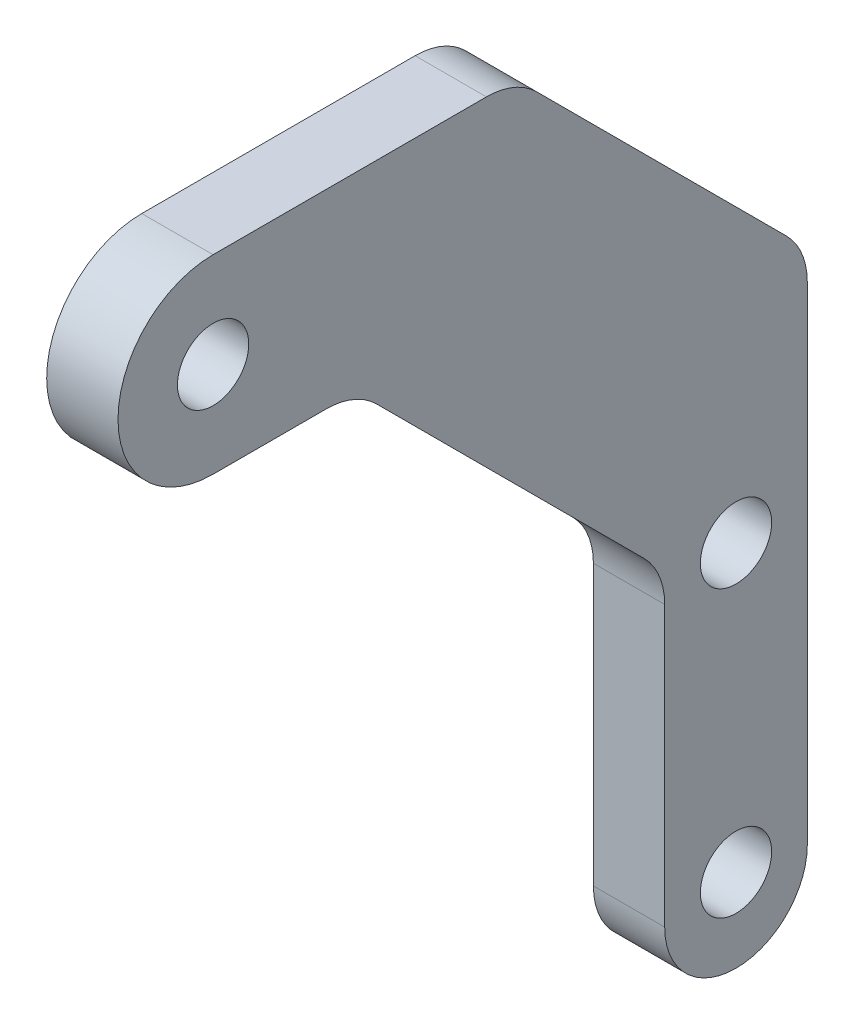
ISO-10303-21;
HEADER;
FILE_DESCRIPTION(('STEP AP214'),'2;1');
FILE_NAME('part.step','',(''),(''),'','','');
FILE_SCHEMA(('AUTOMOTIVE_DESIGN { 1 0 10303 214 1 1 1 1 }'));
ENDSEC;
DATA;
#1=APPLICATION_CONTEXT('core data for automotive mechanical design processes');
#2=APPLICATION_PROTOCOL_DEFINITION('international standard','automotive_design',2000,#1);
#3=PRODUCT_CONTEXT('',#1,'mechanical');
#4=PRODUCT('Part','Part','',(#3));
#5=PRODUCT_RELATED_PRODUCT_CATEGORY('part','',(#4));
#6=PRODUCT_DEFINITION_FORMATION('','',#4);
#7=PRODUCT_DEFINITION_CONTEXT('part definition',#1,'design');
#8=PRODUCT_DEFINITION('design','',#6,#7);
#9=PRODUCT_DEFINITION_SHAPE('','',#8);
#10=(LENGTH_UNIT() NAMED_UNIT(*) SI_UNIT(.MILLI.,.METRE.));
#11=(NAMED_UNIT(*) PLANE_ANGLE_UNIT() SI_UNIT($,.RADIAN.));
#12=(NAMED_UNIT(*) SI_UNIT($,.STERADIAN.) SOLID_ANGLE_UNIT());
#13=UNCERTAINTY_MEASURE_WITH_UNIT(LENGTH_MEASURE(1.E-05),#10,'distance_accuracy_value','');
#14=(GEOMETRIC_REPRESENTATION_CONTEXT(3) GLOBAL_UNCERTAINTY_ASSIGNED_CONTEXT((#13)) GLOBAL_UNIT_ASSIGNED_CONTEXT((#10,
#11,#12)) REPRESENTATION_CONTEXT('',''));
#15=CARTESIAN_POINT('',(0.,0.,0.));
#16=DIRECTION('',(0.,0.,1.));
#17=DIRECTION('',(1.,0.,0.));
#18=AXIS2_PLACEMENT_3D('',#15,#16,#17);
#19=CARTESIAN_POINT('',(1.5,33.,91.));
#20=DIRECTION('',(1.,0.,0.));
#21=DIRECTION('',(0.,0.,-1.));
#22=AXIS2_PLACEMENT_3D('',#19,#20,#21);
#23=PLANE('',#22);
#24=CARTESIAN_POINT('',(1.5,33.,91.));
#25=DIRECTION('',(1.,0.,0.));
#26=DIRECTION('',(0.,0.,-1.));
#27=AXIS2_PLACEMENT_3D('',#24,#25,#26);
#28=CIRCLE('',#27,1.5);
#29=CARTESIAN_POINT('',(1.5,33.,89.5));
#30=VERTEX_POINT('',#29);
#31=EDGE_CURVE('E413',#30,#30,#28,.T.);
#32=ORIENTED_EDGE('',*,*,#31,.F.);
#33=EDGE_LOOP('',(#32));
#34=FACE_BOUND('',#33,.T.);
#35=DIRECTION('',(0.,1.,0.));
#36=VECTOR('',#35,1.);
#37=CARTESIAN_POINT('',(1.5,0.,66.));
#38=LINE('',#37,#36);
#39=CARTESIAN_POINT('',(1.5,3.,66.));
#40=VERTEX_POINT('',#39);
#41=CARTESIAN_POINT('',(1.5,23.5,66.));
#42=VERTEX_POINT('',#41);
#43=EDGE_CURVE('E219',#40,#42,#38,.T.);
#44=ORIENTED_EDGE('',*,*,#43,.T.);
#45=CARTESIAN_POINT('',(1.5,23.5,69.));
#46=DIRECTION('',(1.,0.,0.));
#47=DIRECTION('',(0.,0.,-1.));
#48=AXIS2_PLACEMENT_3D('',#45,#46,#47);
#49=CIRCLE('',#48,3.);
#50=CARTESIAN_POINT('',(1.5,25.6213203435596,66.8786796564403));
#51=VERTEX_POINT('',#50);
#52=EDGE_CURVE('E178',#42,#51,#49,.T.);
#53=ORIENTED_EDGE('',*,*,#52,.T.);
#54=DIRECTION('',(0.,0.707106781186549,0.707106781186546));
#55=VECTOR('',#54,1.);
#56=CARTESIAN_POINT('',(1.5,37.,78.2573593128807));
#57=LINE('',#56,#55);
#58=CARTESIAN_POINT('',(1.5,36.1213203435596,77.3786796564403));
#59=VERTEX_POINT('',#58);
#60=EDGE_CURVE('E223',#51,#59,#57,.T.);
#61=ORIENTED_EDGE('',*,*,#60,.T.);
#62=CARTESIAN_POINT('',(1.5,34.,79.5));
#63=DIRECTION('',(1.,0.,0.));
#64=DIRECTION('',(0.,0.,-1.));
#65=AXIS2_PLACEMENT_3D('',#62,#63,#64);
#66=CIRCLE('',#65,3.);
#67=CARTESIAN_POINT('',(1.5,37.,79.5));
#68=VERTEX_POINT('',#67);
#69=EDGE_CURVE('E48',#59,#68,#66,.T.);
#70=ORIENTED_EDGE('',*,*,#69,.T.);
#71=DIRECTION('',(0.,0.,1.));
#72=VECTOR('',#71,1.);
#73=CARTESIAN_POINT('',(1.5,37.,78.2573593128807));
#74=LINE('',#73,#72);
#75=CARTESIAN_POINT('',(1.5,37.,91.));
#76=VERTEX_POINT('',#75);
#77=EDGE_CURVE('E143',#68,#76,#74,.T.);
#78=ORIENTED_EDGE('',*,*,#77,.T.);
#79=CARTESIAN_POINT('',(1.5,33.,91.));
#80=DIRECTION('',(1.,0.,0.));
#81=DIRECTION('',(0.,0.,-1.));
#82=AXIS2_PLACEMENT_3D('',#79,#80,#81);
#83=CIRCLE('',#82,4.);
#84=CARTESIAN_POINT('',(1.5,29.,91.));
#85=VERTEX_POINT('',#84);
#86=EDGE_CURVE('E138',#76,#85,#83,.T.);
#87=ORIENTED_EDGE('',*,*,#86,.T.);
#88=DIRECTION('',(0.,0.,-1.));
#89=VECTOR('',#88,1.);
#90=CARTESIAN_POINT('',(1.5,29.,91.));
#91=LINE('',#90,#89);
#92=CARTESIAN_POINT('',(1.5,29.,86.2426406871192));
#93=VERTEX_POINT('',#92);
#94=EDGE_CURVE('E127',#85,#93,#91,.T.);
#95=ORIENTED_EDGE('',*,*,#94,.T.);
#96=CARTESIAN_POINT('',(1.5,26.,86.2426406871192));
#97=DIRECTION('',(1.,0.,0.));
#98=DIRECTION('',(0.,0.,-1.));
#99=AXIS2_PLACEMENT_3D('',#96,#97,#98);
#100=CIRCLE('',#99,3.);
#101=CARTESIAN_POINT('',(1.5,28.1213203435596,84.1213203435596));
#102=VERTEX_POINT('',#101);
#103=EDGE_CURVE('E11',#93,#102,#100,.F.);
#104=ORIENTED_EDGE('',*,*,#103,.T.);
#105=DIRECTION('',(0.,-0.707106781186549,-0.707106781186546));
#106=VECTOR('',#105,1.);
#107=CARTESIAN_POINT('',(1.5,29.,85.));
#108=LINE('',#107,#106);
#109=CARTESIAN_POINT('',(1.5,16.8786796564403,72.8786796564404));
#110=VERTEX_POINT('',#109);
#111=EDGE_CURVE('E137',#102,#110,#108,.T.);
#112=ORIENTED_EDGE('',*,*,#111,.T.);
#113=CARTESIAN_POINT('',(1.5,14.7573593128807,75.));
#114=DIRECTION('',(1.,0.,0.));
#115=DIRECTION('',(0.,0.,-1.));
#116=AXIS2_PLACEMENT_3D('',#113,#114,#115);
#117=CIRCLE('',#116,3.);
#118=CARTESIAN_POINT('',(1.5,14.7573593128807,72.));
#119=VERTEX_POINT('',#118);
#120=EDGE_CURVE('E197',#110,#119,#117,.F.);
#121=ORIENTED_EDGE('',*,*,#120,.T.);
#122=DIRECTION('',(0.,-1.,0.));
#123=VECTOR('',#122,1.);
#124=CARTESIAN_POINT('',(1.5,16.,72.));
#125=LINE('',#124,#123);
#126=CARTESIAN_POINT('',(1.5,3.,72.));
#127=VERTEX_POINT('',#126);
#128=EDGE_CURVE('E217',#119,#127,#125,.T.);
#129=ORIENTED_EDGE('',*,*,#128,.T.);
#130=CARTESIAN_POINT('',(1.5,3.,69.));
#131=DIRECTION('',(1.,0.,0.));
#132=DIRECTION('',(0.,0.,-1.));
#133=AXIS2_PLACEMENT_3D('',#130,#131,#132);
#134=CIRCLE('',#133,3.);
#135=CARTESIAN_POINT('',(1.5,0.,69.));
#136=VERTEX_POINT('',#135);
#137=EDGE_CURVE('E55',#127,#136,#134,.T.);
#138=ORIENTED_EDGE('',*,*,#137,.T.);
#139=CARTESIAN_POINT('',(1.5,3.,69.));
#140=DIRECTION('',(1.,0.,0.));
#141=DIRECTION('',(0.,0.,-1.));
#142=AXIS2_PLACEMENT_3D('',#139,#140,#141);
#143=CIRCLE('',#142,3.);
#144=EDGE_CURVE('E174',#136,#40,#143,.T.);
#145=ORIENTED_EDGE('',*,*,#144,.T.);
#146=EDGE_LOOP('',(#44,#53,#61,#70,#78,#87,#95,#104,#112,#121,#129,#138,#145));
#147=FACE_BOUND('',#146,.T.);
#148=CARTESIAN_POINT('',(1.5,3.49999999999999,69.));
#149=DIRECTION('',(1.,0.,0.));
#150=DIRECTION('',(0.,0.,-1.));
#151=AXIS2_PLACEMENT_3D('',#148,#149,#150);
#152=CIRCLE('',#151,1.5);
#153=CARTESIAN_POINT('',(1.5,3.49999999999999,67.5));
#154=VERTEX_POINT('',#153);
#155=EDGE_CURVE('E226',#154,#154,#152,.T.);
#156=ORIENTED_EDGE('',*,*,#155,.F.);
#157=EDGE_LOOP('',(#156));
#158=FACE_BOUND('',#157,.T.);
#159=CARTESIAN_POINT('',(1.5,15.5,69.));
#160=DIRECTION('',(1.,0.,0.));
#161=DIRECTION('',(0.,0.,-1.));
#162=AXIS2_PLACEMENT_3D('',#159,#160,#161);
#163=CIRCLE('',#162,1.5);
#164=CARTESIAN_POINT('',(1.5,15.5,67.5));
#165=VERTEX_POINT('',#164);
#166=EDGE_CURVE('E405',#165,#165,#163,.T.);
#167=ORIENTED_EDGE('',*,*,#166,.F.);
#168=EDGE_LOOP('',(#167));
#169=FACE_BOUND('',#168,.T.);
#170=ADVANCED_FACE('F32',(#34,#147,#158,#169),#23,.T.);
#171=CARTESIAN_POINT('',(-1.5,33.,91.));
#172=DIRECTION('',(1.,0.,0.));
#173=DIRECTION('',(0.,0.,-1.));
#174=AXIS2_PLACEMENT_3D('',#171,#172,#173);
#175=PLANE('',#174);
#176=CARTESIAN_POINT('',(-1.5,33.,91.));
#177=DIRECTION('',(1.,0.,0.));
#178=DIRECTION('',(0.,0.,-1.));
#179=AXIS2_PLACEMENT_3D('',#176,#177,#178);
#180=CIRCLE('',#179,1.5);
#181=CARTESIAN_POINT('',(-1.5,33.,89.5));
#182=VERTEX_POINT('',#181);
#183=EDGE_CURVE('E410',#182,#182,#180,.T.);
#184=ORIENTED_EDGE('',*,*,#183,.T.);
#185=EDGE_LOOP('',(#184));
#186=FACE_BOUND('',#185,.T.);
#187=DIRECTION('',(0.,0.707106781186549,0.707106781186546));
#188=VECTOR('',#187,1.);
#189=CARTESIAN_POINT('',(-1.5,37.,78.2573593128807));
#190=LINE('',#189,#188);
#191=CARTESIAN_POINT('',(-1.5,25.6213203435596,66.8786796564403));
#192=VERTEX_POINT('',#191);
#193=CARTESIAN_POINT('',(-1.5,36.1213203435596,77.3786796564403));
#194=VERTEX_POINT('',#193);
#195=EDGE_CURVE('E235',#192,#194,#190,.T.);
#196=ORIENTED_EDGE('',*,*,#195,.F.);
#197=CARTESIAN_POINT('',(-1.5,23.5,69.));
#198=DIRECTION('',(1.,0.,0.));
#199=DIRECTION('',(0.,0.,-1.));
#200=AXIS2_PLACEMENT_3D('',#197,#198,#199);
#201=CIRCLE('',#200,3.);
#202=CARTESIAN_POINT('',(-1.5,23.5,66.));
#203=VERTEX_POINT('',#202);
#204=EDGE_CURVE('E168',#192,#203,#201,.F.);
#205=ORIENTED_EDGE('',*,*,#204,.T.);
#206=DIRECTION('',(0.,1.,0.));
#207=VECTOR('',#206,1.);
#208=CARTESIAN_POINT('',(-1.5,0.,66.));
#209=LINE('',#208,#207);
#210=CARTESIAN_POINT('',(-1.5,3.,66.));
#211=VERTEX_POINT('',#210);
#212=EDGE_CURVE('E232',#211,#203,#209,.T.);
#213=ORIENTED_EDGE('',*,*,#212,.F.);
#214=CARTESIAN_POINT('',(-1.5,3.,69.));
#215=DIRECTION('',(1.,0.,0.));
#216=DIRECTION('',(0.,0.,-1.));
#217=AXIS2_PLACEMENT_3D('',#214,#215,#216);
#218=CIRCLE('',#217,3.);
#219=CARTESIAN_POINT('',(-1.5,0.,69.));
#220=VERTEX_POINT('',#219);
#221=EDGE_CURVE('E162',#211,#220,#218,.F.);
#222=ORIENTED_EDGE('',*,*,#221,.T.);
#223=CARTESIAN_POINT('',(-1.5,3.,69.));
#224=DIRECTION('',(1.,0.,0.));
#225=DIRECTION('',(0.,0.,-1.));
#226=AXIS2_PLACEMENT_3D('',#223,#224,#225);
#227=CIRCLE('',#226,3.);
#228=CARTESIAN_POINT('',(-1.5,3.,72.));
#229=VERTEX_POINT('',#228);
#230=EDGE_CURVE('E164',#220,#229,#227,.F.);
#231=ORIENTED_EDGE('',*,*,#230,.T.);
#232=DIRECTION('',(0.,-1.,0.));
#233=VECTOR('',#232,1.);
#234=CARTESIAN_POINT('',(-1.5,16.,72.));
#235=LINE('',#234,#233);
#236=CARTESIAN_POINT('',(-1.5,14.7573593128807,72.));
#237=VERTEX_POINT('',#236);
#238=EDGE_CURVE('E229',#237,#229,#235,.T.);
#239=ORIENTED_EDGE('',*,*,#238,.F.);
#240=CARTESIAN_POINT('',(-1.5,14.7573593128807,75.));
#241=DIRECTION('',(1.,0.,0.));
#242=DIRECTION('',(0.,0.,-1.));
#243=AXIS2_PLACEMENT_3D('',#240,#241,#242);
#244=CIRCLE('',#243,3.);
#245=CARTESIAN_POINT('',(-1.5,16.8786796564403,72.8786796564404));
#246=VERTEX_POINT('',#245);
#247=EDGE_CURVE('E195',#237,#246,#244,.T.);
#248=ORIENTED_EDGE('',*,*,#247,.T.);
#249=DIRECTION('',(0.,-0.707106781186549,-0.707106781186546));
#250=VECTOR('',#249,1.);
#251=CARTESIAN_POINT('',(-1.5,29.,85.));
#252=LINE('',#251,#250);
#253=CARTESIAN_POINT('',(-1.5,28.1213203435596,84.1213203435596));
#254=VERTEX_POINT('',#253);
#255=EDGE_CURVE('E206',#254,#246,#252,.T.);
#256=ORIENTED_EDGE('',*,*,#255,.F.);
#257=CARTESIAN_POINT('',(-1.5,26.,86.2426406871192));
#258=DIRECTION('',(1.,0.,0.));
#259=DIRECTION('',(0.,0.,-1.));
#260=AXIS2_PLACEMENT_3D('',#257,#258,#259);
#261=CIRCLE('',#260,3.);
#262=CARTESIAN_POINT('',(-1.5,29.,86.2426406871192));
#263=VERTEX_POINT('',#262);
#264=EDGE_CURVE('E41',#254,#263,#261,.T.);
#265=ORIENTED_EDGE('',*,*,#264,.T.);
#266=DIRECTION('',(0.,0.,-1.));
#267=VECTOR('',#266,1.);
#268=CARTESIAN_POINT('',(-1.5,29.,91.));
#269=LINE('',#268,#267);
#270=CARTESIAN_POINT('',(-1.5,29.,91.));
#271=VERTEX_POINT('',#270);
#272=EDGE_CURVE('E204',#271,#263,#269,.T.);
#273=ORIENTED_EDGE('',*,*,#272,.F.);
#274=CARTESIAN_POINT('',(-1.5,33.,91.));
#275=DIRECTION('',(1.,0.,0.));
#276=DIRECTION('',(0.,0.,-1.));
#277=AXIS2_PLACEMENT_3D('',#274,#275,#276);
#278=CIRCLE('',#277,4.);
#279=CARTESIAN_POINT('',(-1.5,37.,91.));
#280=VERTEX_POINT('',#279);
#281=EDGE_CURVE('E151',#280,#271,#278,.T.);
#282=ORIENTED_EDGE('',*,*,#281,.F.);
#283=DIRECTION('',(0.,0.,1.));
#284=VECTOR('',#283,1.);
#285=CARTESIAN_POINT('',(-1.5,37.,78.2573593128807));
#286=LINE('',#285,#284);
#287=CARTESIAN_POINT('',(-1.5,37.,79.5));
#288=VERTEX_POINT('',#287);
#289=EDGE_CURVE('E147',#288,#280,#286,.T.);
#290=ORIENTED_EDGE('',*,*,#289,.F.);
#291=CARTESIAN_POINT('',(-1.5,34.,79.5));
#292=DIRECTION('',(1.,0.,0.));
#293=DIRECTION('',(0.,0.,-1.));
#294=AXIS2_PLACEMENT_3D('',#291,#292,#293);
#295=CIRCLE('',#294,3.);
#296=EDGE_CURVE('E166',#288,#194,#295,.F.);
#297=ORIENTED_EDGE('',*,*,#296,.T.);
#298=EDGE_LOOP('',(#196,#205,#213,#222,#231,#239,#248,#256,#265,#273,#282,#290,#297));
#299=FACE_BOUND('',#298,.T.);
#300=CARTESIAN_POINT('',(-1.5,3.49999999999999,69.));
#301=DIRECTION('',(1.,0.,0.));
#302=DIRECTION('',(0.,0.,-1.));
#303=AXIS2_PLACEMENT_3D('',#300,#301,#302);
#304=CIRCLE('',#303,1.5);
#305=CARTESIAN_POINT('',(-1.5,3.49999999999999,67.5));
#306=VERTEX_POINT('',#305);
#307=EDGE_CURVE('E416',#306,#306,#304,.T.);
#308=ORIENTED_EDGE('',*,*,#307,.T.);
#309=EDGE_LOOP('',(#308));
#310=FACE_BOUND('',#309,.T.);
#311=CARTESIAN_POINT('',(-1.5,15.5,69.));
#312=DIRECTION('',(1.,0.,0.));
#313=DIRECTION('',(0.,0.,-1.));
#314=AXIS2_PLACEMENT_3D('',#311,#312,#313);
#315=CIRCLE('',#314,1.5);
#316=CARTESIAN_POINT('',(-1.5,15.5,67.5));
#317=VERTEX_POINT('',#316);
#318=EDGE_CURVE('E403',#317,#317,#315,.T.);
#319=ORIENTED_EDGE('',*,*,#318,.T.);
#320=EDGE_LOOP('',(#319));
#321=FACE_BOUND('',#320,.T.);
#322=ADVANCED_FACE('F202',(#186,#299,#310,#321),#175,.F.);
#323=CARTESIAN_POINT('',(1.5,33.,91.));
#324=DIRECTION('',(-1.,0.,0.));
#325=DIRECTION('',(0.,0.,1.));
#326=AXIS2_PLACEMENT_3D('',#323,#324,#325);
#327=CYLINDRICAL_SURFACE('',#326,4.);
#328=ORIENTED_EDGE('',*,*,#281,.T.);
#329=DIRECTION('',(-1.,0.,0.));
#330=VECTOR('',#329,1.);
#331=CARTESIAN_POINT('',(1.5,29.,91.));
#332=LINE('',#331,#330);
#333=EDGE_CURVE('E132',#85,#271,#332,.T.);
#334=ORIENTED_EDGE('',*,*,#333,.F.);
#335=ORIENTED_EDGE('',*,*,#86,.F.);
#336=DIRECTION('',(-1.,0.,0.));
#337=VECTOR('',#336,1.);
#338=CARTESIAN_POINT('',(1.5,37.,91.));
#339=LINE('',#338,#337);
#340=EDGE_CURVE('E153',#76,#280,#339,.T.);
#341=ORIENTED_EDGE('',*,*,#340,.T.);
#342=EDGE_LOOP('',(#328,#334,#335,#341));
#343=FACE_BOUND('',#342,.T.);
#344=ADVANCED_FACE('F149',(#343),#327,.T.);
#345=CARTESIAN_POINT('',(1.5,29.,91.));
#346=DIRECTION('',(0.,1.,0.));
#347=DIRECTION('',(0.,0.,1.));
#348=AXIS2_PLACEMENT_3D('',#345,#346,#347);
#349=PLANE('',#348);
#350=ORIENTED_EDGE('',*,*,#272,.T.);
#351=DIRECTION('',(-1.,0.,0.));
#352=VECTOR('',#351,1.);
#353=CARTESIAN_POINT('',(1.5,29.,86.2426406871192));
#354=LINE('',#353,#352);
#355=EDGE_CURVE('E135',#263,#93,#354,.F.);
#356=ORIENTED_EDGE('',*,*,#355,.T.);
#357=ORIENTED_EDGE('',*,*,#94,.F.);
#358=ORIENTED_EDGE('',*,*,#333,.T.);
#359=EDGE_LOOP('',(#350,#356,#357,#358));
#360=FACE_BOUND('',#359,.T.);
#361=ADVANCED_FACE('F130',(#360),#349,.F.);
#362=CARTESIAN_POINT('',(1.5,29.,85.));
#363=DIRECTION('',(0.,0.707106781186546,-0.707106781186549));
#364=DIRECTION('',(0.,0.707106781186549,0.707106781186546));
#365=AXIS2_PLACEMENT_3D('',#362,#363,#364);
#366=PLANE('',#365);
#367=ORIENTED_EDGE('',*,*,#255,.T.);
#368=DIRECTION('',(-1.,0.,0.));
#369=VECTOR('',#368,1.);
#370=CARTESIAN_POINT('',(1.5,16.8786796564404,72.8786796564404));
#371=LINE('',#370,#369);
#372=EDGE_CURVE('E192',#246,#110,#371,.F.);
#373=ORIENTED_EDGE('',*,*,#372,.T.);
#374=ORIENTED_EDGE('',*,*,#111,.F.);
#375=DIRECTION('',(-1.,0.,0.));
#376=VECTOR('',#375,1.);
#377=CARTESIAN_POINT('',(-1.5,28.1213203435596,84.1213203435596));
#378=LINE('',#377,#376);
#379=EDGE_CURVE('E189',#102,#254,#378,.T.);
#380=ORIENTED_EDGE('',*,*,#379,.T.);
#381=EDGE_LOOP('',(#367,#373,#374,#380));
#382=FACE_BOUND('',#381,.T.);
#383=ADVANCED_FACE('F215',(#382),#366,.F.);
#384=CARTESIAN_POINT('',(1.5,16.,72.));
#385=DIRECTION('',(0.,0.,-1.));
#386=DIRECTION('',(-1.,0.,0.));
#387=AXIS2_PLACEMENT_3D('',#384,#385,#386);
#388=PLANE('',#387);
#389=ORIENTED_EDGE('',*,*,#128,.F.);
#390=DIRECTION('',(-1.,0.,0.));
#391=VECTOR('',#390,1.);
#392=CARTESIAN_POINT('',(-1.5,14.7573593128807,72.));
#393=LINE('',#392,#391);
#394=EDGE_CURVE('E186',#119,#237,#393,.T.);
#395=ORIENTED_EDGE('',*,*,#394,.T.);
#396=ORIENTED_EDGE('',*,*,#238,.T.);
#397=DIRECTION('',(-1.,0.,0.));
#398=VECTOR('',#397,1.);
#399=CARTESIAN_POINT('',(1.5,3.,72.));
#400=LINE('',#399,#398);
#401=EDGE_CURVE('E183',#229,#127,#400,.F.);
#402=ORIENTED_EDGE('',*,*,#401,.T.);
#403=EDGE_LOOP('',(#389,#395,#396,#402));
#404=FACE_BOUND('',#403,.T.);
#405=ADVANCED_FACE('F281',(#404),#388,.F.);
#406=CARTESIAN_POINT('',(1.5,0.,66.));
#407=DIRECTION('',(0.,0.,1.));
#408=DIRECTION('',(1.,0.,0.));
#409=AXIS2_PLACEMENT_3D('',#406,#407,#408);
#410=PLANE('',#409);
#411=ORIENTED_EDGE('',*,*,#212,.T.);
#412=DIRECTION('',(-1.,0.,0.));
#413=VECTOR('',#412,1.);
#414=CARTESIAN_POINT('',(1.5,23.5,66.));
#415=LINE('',#414,#413);
#416=EDGE_CURVE('E172',#203,#42,#415,.F.);
#417=ORIENTED_EDGE('',*,*,#416,.T.);
#418=ORIENTED_EDGE('',*,*,#43,.F.);
#419=DIRECTION('',(-1.,0.,0.));
#420=VECTOR('',#419,1.);
#421=CARTESIAN_POINT('',(1.5,3.,66.));
#422=LINE('',#421,#420);
#423=EDGE_CURVE('E170',#40,#211,#422,.T.);
#424=ORIENTED_EDGE('',*,*,#423,.T.);
#425=EDGE_LOOP('',(#411,#417,#418,#424));
#426=FACE_BOUND('',#425,.T.);
#427=ADVANCED_FACE('F278',(#426),#410,.F.);
#428=CARTESIAN_POINT('',(1.5,37.,78.2573593128807));
#429=DIRECTION('',(0.,-0.707106781186546,0.707106781186549));
#430=DIRECTION('',(0.,-0.707106781186549,-0.707106781186546));
#431=AXIS2_PLACEMENT_3D('',#428,#429,#430);
#432=PLANE('',#431);
#433=ORIENTED_EDGE('',*,*,#60,.F.);
#434=DIRECTION('',(-1.,0.,0.));
#435=VECTOR('',#434,1.);
#436=CARTESIAN_POINT('',(1.5,25.6213203435596,66.8786796564403));
#437=LINE('',#436,#435);
#438=EDGE_CURVE('E155',#51,#192,#437,.T.);
#439=ORIENTED_EDGE('',*,*,#438,.T.);
#440=ORIENTED_EDGE('',*,*,#195,.T.);
#441=DIRECTION('',(-1.,0.,0.));
#442=VECTOR('',#441,1.);
#443=CARTESIAN_POINT('',(1.5,36.1213203435596,77.3786796564403));
#444=LINE('',#443,#442);
#445=EDGE_CURVE('E152',#194,#59,#444,.F.);
#446=ORIENTED_EDGE('',*,*,#445,.T.);
#447=EDGE_LOOP('',(#433,#439,#440,#446));
#448=FACE_BOUND('',#447,.T.);
#449=ADVANCED_FACE('F245',(#448),#432,.F.);
#450=CARTESIAN_POINT('',(1.5,37.,78.2573593128807));
#451=DIRECTION('',(0.,-1.,0.));
#452=DIRECTION('',(0.,0.,-1.));
#453=AXIS2_PLACEMENT_3D('',#450,#451,#452);
#454=PLANE('',#453);
#455=ORIENTED_EDGE('',*,*,#77,.F.);
#456=DIRECTION('',(-1.,0.,0.));
#457=VECTOR('',#456,1.);
#458=CARTESIAN_POINT('',(1.5,37.,79.5));
#459=LINE('',#458,#457);
#460=EDGE_CURVE('E180',#68,#288,#459,.T.);
#461=ORIENTED_EDGE('',*,*,#460,.T.);
#462=ORIENTED_EDGE('',*,*,#289,.T.);
#463=ORIENTED_EDGE('',*,*,#340,.F.);
#464=EDGE_LOOP('',(#455,#461,#462,#463));
#465=FACE_BOUND('',#464,.T.);
#466=ADVANCED_FACE('F239',(#465),#454,.F.);
#467=CARTESIAN_POINT('',(1.5,3.49999999999999,69.));
#468=DIRECTION('',(-1.,0.,0.));
#469=DIRECTION('',(0.,0.,1.));
#470=AXIS2_PLACEMENT_3D('',#467,#468,#469);
#471=CYLINDRICAL_SURFACE('',#470,1.5);
#472=ORIENTED_EDGE('',*,*,#155,.T.);
#473=EDGE_LOOP('',(#472));
#474=FACE_BOUND('',#473,.T.);
#475=ORIENTED_EDGE('',*,*,#307,.F.);
#476=EDGE_LOOP('',(#475));
#477=FACE_BOUND('',#476,.T.);
#478=ADVANCED_FACE('F271',(#474,#477),#471,.F.);
#479=CARTESIAN_POINT('',(1.5,33.,91.));
#480=DIRECTION('',(-1.,0.,0.));
#481=DIRECTION('',(0.,0.,1.));
#482=AXIS2_PLACEMENT_3D('',#479,#480,#481);
#483=CYLINDRICAL_SURFACE('',#482,1.5);
#484=ORIENTED_EDGE('',*,*,#31,.T.);
#485=EDGE_LOOP('',(#484));
#486=FACE_BOUND('',#485,.T.);
#487=ORIENTED_EDGE('',*,*,#183,.F.);
#488=EDGE_LOOP('',(#487));
#489=FACE_BOUND('',#488,.T.);
#490=ADVANCED_FACE('F332',(#486,#489),#483,.F.);
#491=CARTESIAN_POINT('',(1.5,15.5,69.));
#492=DIRECTION('',(-1.,0.,0.));
#493=DIRECTION('',(0.,0.,1.));
#494=AXIS2_PLACEMENT_3D('',#491,#492,#493);
#495=CYLINDRICAL_SURFACE('',#494,1.5);
#496=ORIENTED_EDGE('',*,*,#166,.T.);
#497=EDGE_LOOP('',(#496));
#498=FACE_BOUND('',#497,.T.);
#499=ORIENTED_EDGE('',*,*,#318,.F.);
#500=EDGE_LOOP('',(#499));
#501=FACE_BOUND('',#500,.T.);
#502=ADVANCED_FACE('F258',(#498,#501),#495,.F.);
#503=CARTESIAN_POINT('',(1.5,23.5,69.));
#504=DIRECTION('',(-1.,0.,0.));
#505=DIRECTION('',(0.,0.,1.));
#506=AXIS2_PLACEMENT_3D('',#503,#504,#505);
#507=CYLINDRICAL_SURFACE('',#506,3.);
#508=ORIENTED_EDGE('',*,*,#52,.F.);
#509=ORIENTED_EDGE('',*,*,#416,.F.);
#510=ORIENTED_EDGE('',*,*,#204,.F.);
#511=ORIENTED_EDGE('',*,*,#438,.F.);
#512=EDGE_LOOP('',(#508,#509,#510,#511));
#513=FACE_BOUND('',#512,.T.);
#514=ADVANCED_FACE('F250',(#513),#507,.T.);
#515=CARTESIAN_POINT('',(1.5,34.,79.5));
#516=DIRECTION('',(-1.,0.,0.));
#517=DIRECTION('',(0.,0.,1.));
#518=AXIS2_PLACEMENT_3D('',#515,#516,#517);
#519=CYLINDRICAL_SURFACE('',#518,3.);
#520=ORIENTED_EDGE('',*,*,#69,.F.);
#521=ORIENTED_EDGE('',*,*,#445,.F.);
#522=ORIENTED_EDGE('',*,*,#296,.F.);
#523=ORIENTED_EDGE('',*,*,#460,.F.);
#524=EDGE_LOOP('',(#520,#521,#522,#523));
#525=FACE_BOUND('',#524,.T.);
#526=ADVANCED_FACE('F247',(#525),#519,.T.);
#527=CARTESIAN_POINT('',(1.5,14.7573593128807,75.));
#528=DIRECTION('',(1.,0.,0.));
#529=DIRECTION('',(0.,0.,-1.));
#530=AXIS2_PLACEMENT_3D('',#527,#528,#529);
#531=CYLINDRICAL_SURFACE('',#530,3.);
#532=ORIENTED_EDGE('',*,*,#120,.F.);
#533=ORIENTED_EDGE('',*,*,#372,.F.);
#534=ORIENTED_EDGE('',*,*,#247,.F.);
#535=ORIENTED_EDGE('',*,*,#394,.F.);
#536=EDGE_LOOP('',(#532,#533,#534,#535));
#537=FACE_BOUND('',#536,.T.);
#538=ADVANCED_FACE('F249',(#537),#531,.F.);
#539=CARTESIAN_POINT('',(1.5,26.,86.2426406871192));
#540=DIRECTION('',(1.,0.,0.));
#541=DIRECTION('',(0.,0.,-1.));
#542=AXIS2_PLACEMENT_3D('',#539,#540,#541);
#543=CYLINDRICAL_SURFACE('',#542,3.);
#544=ORIENTED_EDGE('',*,*,#103,.F.);
#545=ORIENTED_EDGE('',*,*,#355,.F.);
#546=ORIENTED_EDGE('',*,*,#264,.F.);
#547=ORIENTED_EDGE('',*,*,#379,.F.);
#548=EDGE_LOOP('',(#544,#545,#546,#547));
#549=FACE_BOUND('',#548,.T.);
#550=ADVANCED_FACE('F210',(#549),#543,.F.);
#551=CARTESIAN_POINT('',(1.5,3.,69.));
#552=DIRECTION('',(-1.,0.,0.));
#553=DIRECTION('',(0.,0.,1.));
#554=AXIS2_PLACEMENT_3D('',#551,#552,#553);
#555=CYLINDRICAL_SURFACE('',#554,3.);
#556=ORIENTED_EDGE('',*,*,#423,.F.);
#557=ORIENTED_EDGE('',*,*,#144,.F.);
#558=DIRECTION('',(-1.,0.,0.));
#559=VECTOR('',#558,1.);
#560=CARTESIAN_POINT('',(1.5,0.,69.));
#561=LINE('',#560,#559);
#562=EDGE_CURVE('E36',#220,#136,#561,.F.);
#563=ORIENTED_EDGE('',*,*,#562,.F.);
#564=ORIENTED_EDGE('',*,*,#221,.F.);
#565=EDGE_LOOP('',(#556,#557,#563,#564));
#566=FACE_BOUND('',#565,.T.);
#567=ADVANCED_FACE('F34',(#566),#555,.T.);
#568=CARTESIAN_POINT('',(1.5,3.,69.));
#569=DIRECTION('',(-1.,0.,0.));
#570=DIRECTION('',(0.,0.,1.));
#571=AXIS2_PLACEMENT_3D('',#568,#569,#570);
#572=CYLINDRICAL_SURFACE('',#571,3.);
#573=ORIENTED_EDGE('',*,*,#137,.F.);
#574=ORIENTED_EDGE('',*,*,#401,.F.);
#575=ORIENTED_EDGE('',*,*,#230,.F.);
#576=ORIENTED_EDGE('',*,*,#562,.T.);
#577=EDGE_LOOP('',(#573,#574,#575,#576));
#578=FACE_BOUND('',#577,.T.);
#579=ADVANCED_FACE('F382',(#578),#572,.T.);
#580=CLOSED_SHELL('',(#170,#322,#344,#361,#383,#405,#427,#449,#466,#478,#490,#502,#514,#526,
#538,#550,#567,#579));
#581=MANIFOLD_SOLID_BREP('B2',#580);
#582=ADVANCED_BREP_SHAPE_REPRESENTATION('',(#18,#581),#14);
#583=SHAPE_DEFINITION_REPRESENTATION(#9,#582);
ENDSEC;
END-ISO-10303-21;
